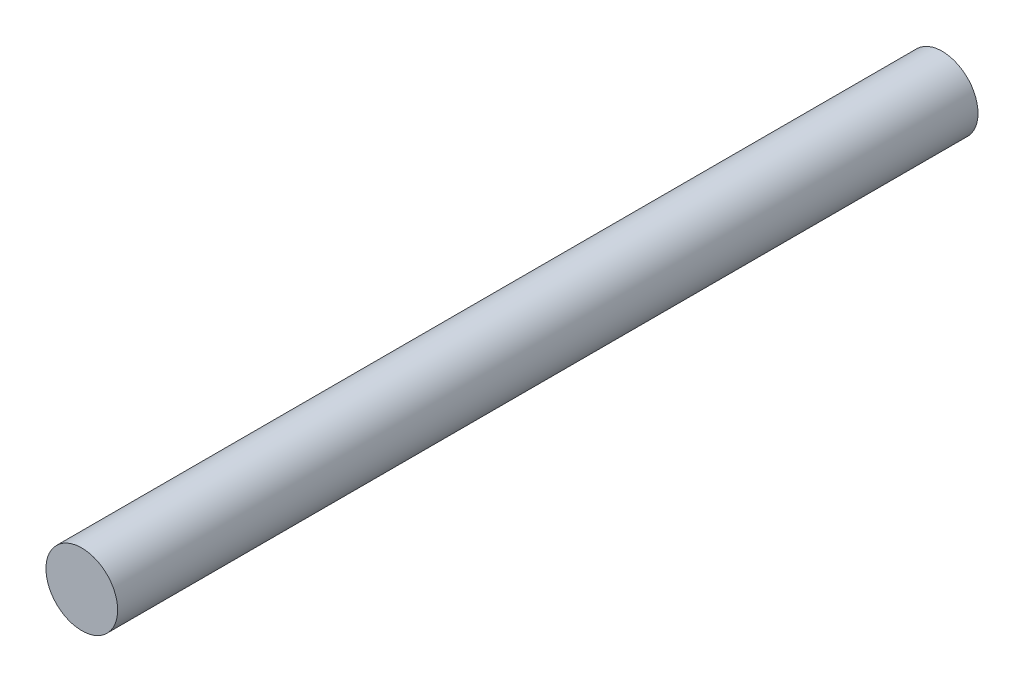
ISO-10303-21;
HEADER;
FILE_DESCRIPTION(('STEP AP214'),'2;1');
FILE_NAME('part.step','',(''),(''),'','','');
FILE_SCHEMA(('AUTOMOTIVE_DESIGN { 1 0 10303 214 1 1 1 1 }'));
ENDSEC;
DATA;
#1=APPLICATION_CONTEXT('core data for automotive mechanical design processes');
#2=APPLICATION_PROTOCOL_DEFINITION('international standard','automotive_design',2000,#1);
#3=PRODUCT_CONTEXT('',#1,'mechanical');
#4=PRODUCT('Part','Part','',(#3));
#5=PRODUCT_RELATED_PRODUCT_CATEGORY('part','',(#4));
#6=PRODUCT_DEFINITION_FORMATION('','',#4);
#7=PRODUCT_DEFINITION_CONTEXT('part definition',#1,'design');
#8=PRODUCT_DEFINITION('design','',#6,#7);
#9=PRODUCT_DEFINITION_SHAPE('','',#8);
#10=(LENGTH_UNIT() NAMED_UNIT(*) SI_UNIT(.MILLI.,.METRE.));
#11=(NAMED_UNIT(*) PLANE_ANGLE_UNIT() SI_UNIT($,.RADIAN.));
#12=(NAMED_UNIT(*) SI_UNIT($,.STERADIAN.) SOLID_ANGLE_UNIT());
#13=UNCERTAINTY_MEASURE_WITH_UNIT(LENGTH_MEASURE(1.E-05),#10,'distance_accuracy_value','');
#14=(GEOMETRIC_REPRESENTATION_CONTEXT(3) GLOBAL_UNCERTAINTY_ASSIGNED_CONTEXT((#13)) GLOBAL_UNIT_ASSIGNED_CONTEXT((#10,
#11,#12)) REPRESENTATION_CONTEXT('',''));
#15=CARTESIAN_POINT('',(0.,0.,0.));
#16=DIRECTION('',(0.,0.,1.));
#17=DIRECTION('',(1.,0.,0.));
#18=AXIS2_PLACEMENT_3D('',#15,#16,#17);
#19=CARTESIAN_POINT('',(0.,0.,152.4));
#20=DIRECTION('',(0.,0.,-1.));
#21=DIRECTION('',(-1.,0.,0.));
#22=AXIS2_PLACEMENT_3D('',#19,#20,#21);
#23=CYLINDRICAL_SURFACE('',#22,6.35);
#24=CARTESIAN_POINT('',(0.,0.,152.4));
#25=DIRECTION('',(0.,0.,1.));
#26=DIRECTION('',(1.,0.,0.));
#27=AXIS2_PLACEMENT_3D('',#24,#25,#26);
#28=CIRCLE('',#27,6.35);
#29=CARTESIAN_POINT('',(6.35,0.,152.4));
#30=VERTEX_POINT('',#29);
#31=EDGE_CURVE('E10',#30,#30,#28,.T.);
#32=ORIENTED_EDGE('',*,*,#31,.F.);
#33=EDGE_LOOP('',(#32));
#34=FACE_BOUND('',#33,.T.);
#35=CARTESIAN_POINT('',(0.,0.,0.));
#36=DIRECTION('',(0.,0.,1.));
#37=DIRECTION('',(1.,0.,0.));
#38=AXIS2_PLACEMENT_3D('',#35,#36,#37);
#39=CIRCLE('',#38,6.35);
#40=CARTESIAN_POINT('',(6.35,0.,0.));
#41=VERTEX_POINT('',#40);
#42=EDGE_CURVE('E46',#41,#41,#39,.T.);
#43=ORIENTED_EDGE('',*,*,#42,.T.);
#44=EDGE_LOOP('',(#43));
#45=FACE_BOUND('',#44,.T.);
#46=ADVANCED_FACE('F43',(#34,#45),#23,.T.);
#47=CARTESIAN_POINT('',(0.,0.,152.4));
#48=DIRECTION('',(0.,0.,1.));
#49=DIRECTION('',(1.,0.,0.));
#50=AXIS2_PLACEMENT_3D('',#47,#48,#49);
#51=PLANE('',#50);
#52=ORIENTED_EDGE('',*,*,#31,.T.);
#53=EDGE_LOOP('',(#52));
#54=FACE_BOUND('',#53,.T.);
#55=ADVANCED_FACE('F60',(#54),#51,.T.);
#56=CARTESIAN_POINT('',(0.,0.,0.));
#57=DIRECTION('',(0.,0.,1.));
#58=DIRECTION('',(1.,0.,0.));
#59=AXIS2_PLACEMENT_3D('',#56,#57,#58);
#60=PLANE('',#59);
#61=ORIENTED_EDGE('',*,*,#42,.F.);
#62=EDGE_LOOP('',(#61));
#63=FACE_BOUND('',#62,.T.);
#64=ADVANCED_FACE('F58',(#63),#60,.F.);
#65=CLOSED_SHELL('',(#46,#55,#64));
#66=MANIFOLD_SOLID_BREP('B2',#65);
#67=ADVANCED_BREP_SHAPE_REPRESENTATION('',(#18,#66),#14);
#68=SHAPE_DEFINITION_REPRESENTATION(#9,#67);
ENDSEC;
END-ISO-10303-21;
